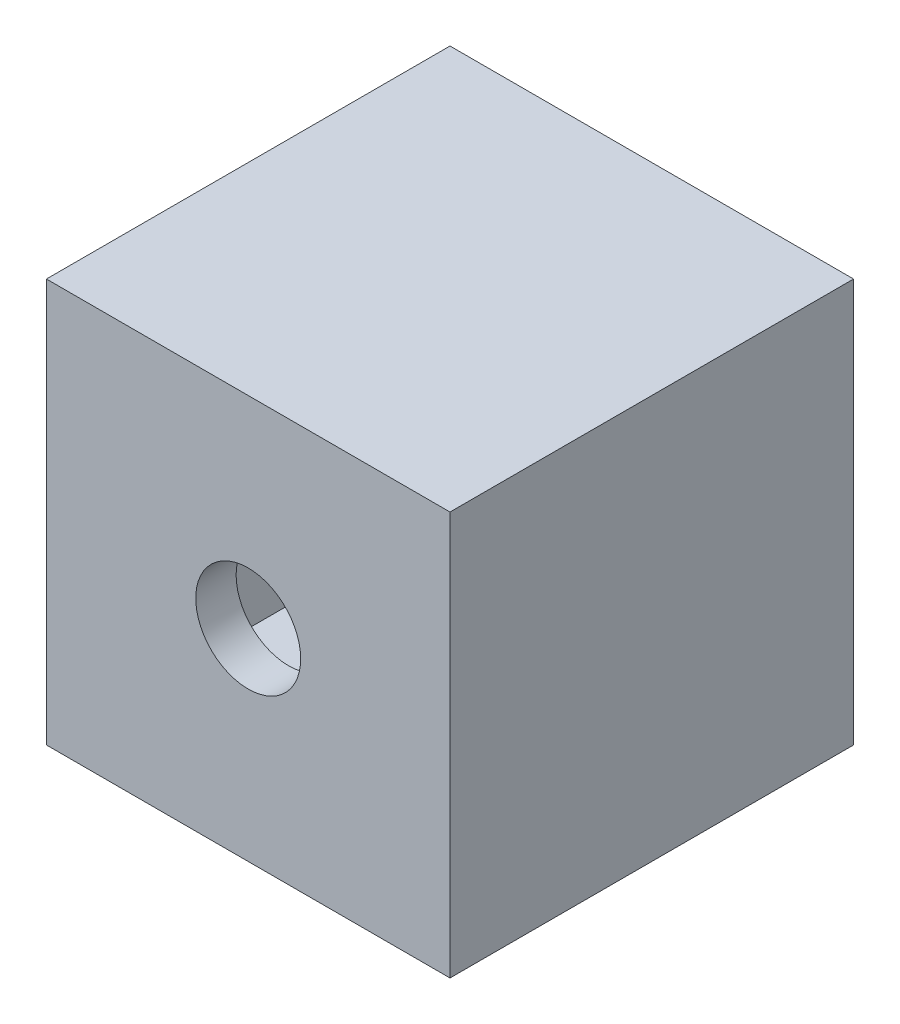
ISO-10303-21;
HEADER;
FILE_DESCRIPTION(('STEP AP214'),'2;1');
FILE_NAME('part.step','',(''),(''),'','','');
FILE_SCHEMA(('AUTOMOTIVE_DESIGN { 1 0 10303 214 1 1 1 1 }'));
ENDSEC;
DATA;
#1=APPLICATION_CONTEXT('core data for automotive mechanical design processes');
#2=APPLICATION_PROTOCOL_DEFINITION('international standard','automotive_design',2000,#1);
#3=PRODUCT_CONTEXT('',#1,'mechanical');
#4=PRODUCT('Part','Part','',(#3));
#5=PRODUCT_RELATED_PRODUCT_CATEGORY('part','',(#4));
#6=PRODUCT_DEFINITION_FORMATION('','',#4);
#7=PRODUCT_DEFINITION_CONTEXT('part definition',#1,'design');
#8=PRODUCT_DEFINITION('design','',#6,#7);
#9=PRODUCT_DEFINITION_SHAPE('','',#8);
#10=(LENGTH_UNIT() NAMED_UNIT(*) SI_UNIT(.MILLI.,.METRE.));
#11=(NAMED_UNIT(*) PLANE_ANGLE_UNIT() SI_UNIT($,.RADIAN.));
#12=(NAMED_UNIT(*) SI_UNIT($,.STERADIAN.) SOLID_ANGLE_UNIT());
#13=UNCERTAINTY_MEASURE_WITH_UNIT(LENGTH_MEASURE(1.E-05),#10,'distance_accuracy_value','');
#14=(GEOMETRIC_REPRESENTATION_CONTEXT(3) GLOBAL_UNCERTAINTY_ASSIGNED_CONTEXT((#13)) GLOBAL_UNIT_ASSIGNED_CONTEXT((#10,
#11,#12)) REPRESENTATION_CONTEXT('',''));
#15=CARTESIAN_POINT('',(0.,0.,0.));
#16=DIRECTION('',(0.,0.,1.));
#17=DIRECTION('',(1.,0.,0.));
#18=AXIS2_PLACEMENT_3D('',#15,#16,#17);
#19=CARTESIAN_POINT('',(0.,0.,0.));
#20=DIRECTION('',(0.,0.,-1.));
#21=DIRECTION('',(-1.,0.,0.));
#22=AXIS2_PLACEMENT_3D('',#19,#20,#21);
#23=PLANE('',#22);
#24=DIRECTION('',(0.,1.,0.));
#25=VECTOR('',#24,1.);
#26=CARTESIAN_POINT('',(100.,-100.,0.));
#27=LINE('',#26,#25);
#28=CARTESIAN_POINT('',(100.,-100.,0.));
#29=VERTEX_POINT('',#28);
#30=CARTESIAN_POINT('',(100.,100.,0.));
#31=VERTEX_POINT('',#30);
#32=EDGE_CURVE('E133',#29,#31,#27,.T.);
#33=ORIENTED_EDGE('',*,*,#32,.F.);
#34=DIRECTION('',(1.,0.,0.));
#35=VECTOR('',#34,1.);
#36=CARTESIAN_POINT('',(-100.,-100.,0.));
#37=LINE('',#36,#35);
#38=CARTESIAN_POINT('',(-100.,-100.,0.));
#39=VERTEX_POINT('',#38);
#40=EDGE_CURVE('E81',#39,#29,#37,.T.);
#41=ORIENTED_EDGE('',*,*,#40,.F.);
#42=DIRECTION('',(0.,-1.,0.));
#43=VECTOR('',#42,1.);
#44=CARTESIAN_POINT('',(-100.,-100.,0.));
#45=LINE('',#44,#43);
#46=CARTESIAN_POINT('',(-100.,100.,0.));
#47=VERTEX_POINT('',#46);
#48=EDGE_CURVE('E163',#47,#39,#45,.T.);
#49=ORIENTED_EDGE('',*,*,#48,.F.);
#50=DIRECTION('',(-1.,0.,0.));
#51=VECTOR('',#50,1.);
#52=CARTESIAN_POINT('',(-100.,100.,0.));
#53=LINE('',#52,#51);
#54=EDGE_CURVE('E137',#31,#47,#53,.T.);
#55=ORIENTED_EDGE('',*,*,#54,.F.);
#56=EDGE_LOOP('',(#33,#41,#49,#55));
#57=FACE_BOUND('',#56,.T.);
#58=DIRECTION('',(1.,0.,0.));
#59=VECTOR('',#58,1.);
#60=CARTESIAN_POINT('',(0.,-80.,0.));
#61=LINE('',#60,#59);
#62=CARTESIAN_POINT('',(-80.,-80.,0.));
#63=VERTEX_POINT('',#62);
#64=CARTESIAN_POINT('',(80.,-80.,0.));
#65=VERTEX_POINT('',#64);
#66=EDGE_CURVE('E128',#63,#65,#61,.T.);
#67=ORIENTED_EDGE('',*,*,#66,.T.);
#68=DIRECTION('',(0.,1.,0.));
#69=VECTOR('',#68,1.);
#70=CARTESIAN_POINT('',(80.,0.,0.));
#71=LINE('',#70,#69);
#72=CARTESIAN_POINT('',(80.,80.,0.));
#73=VERTEX_POINT('',#72);
#74=EDGE_CURVE('E149',#65,#73,#71,.T.);
#75=ORIENTED_EDGE('',*,*,#74,.T.);
#76=DIRECTION('',(-1.,0.,0.));
#77=VECTOR('',#76,1.);
#78=CARTESIAN_POINT('',(0.,80.,0.));
#79=LINE('',#78,#77);
#80=CARTESIAN_POINT('',(-80.,80.,0.));
#81=VERTEX_POINT('',#80);
#82=EDGE_CURVE('E132',#73,#81,#79,.T.);
#83=ORIENTED_EDGE('',*,*,#82,.T.);
#84=DIRECTION('',(0.,-1.,0.));
#85=VECTOR('',#84,1.);
#86=CARTESIAN_POINT('',(-80.,0.,0.));
#87=LINE('',#86,#85);
#88=EDGE_CURVE('E51',#81,#63,#87,.T.);
#89=ORIENTED_EDGE('',*,*,#88,.T.);
#90=EDGE_LOOP('',(#67,#75,#83,#89));
#91=FACE_BOUND('',#90,.T.);
#92=ADVANCED_FACE('F35',(#57,#91),#23,.T.);
#93=CARTESIAN_POINT('',(100.,-100.,200.));
#94=DIRECTION('',(-1.,0.,0.));
#95=DIRECTION('',(0.,0.,1.));
#96=AXIS2_PLACEMENT_3D('',#93,#94,#95);
#97=PLANE('',#96);
#98=ORIENTED_EDGE('',*,*,#32,.T.);
#99=DIRECTION('',(0.,0.,-1.));
#100=VECTOR('',#99,1.);
#101=CARTESIAN_POINT('',(100.,100.,200.));
#102=LINE('',#101,#100);
#103=CARTESIAN_POINT('',(100.,100.,200.));
#104=VERTEX_POINT('',#103);
#105=EDGE_CURVE('E11',#104,#31,#102,.T.);
#106=ORIENTED_EDGE('',*,*,#105,.F.);
#107=DIRECTION('',(0.,1.,0.));
#108=VECTOR('',#107,1.);
#109=CARTESIAN_POINT('',(100.,-100.,200.));
#110=LINE('',#109,#108);
#111=CARTESIAN_POINT('',(100.,-100.,200.));
#112=VERTEX_POINT('',#111);
#113=EDGE_CURVE('E155',#112,#104,#110,.T.);
#114=ORIENTED_EDGE('',*,*,#113,.F.);
#115=DIRECTION('',(0.,0.,-1.));
#116=VECTOR('',#115,1.);
#117=CARTESIAN_POINT('',(100.,-100.,200.));
#118=LINE('',#117,#116);
#119=EDGE_CURVE('E160',#112,#29,#118,.T.);
#120=ORIENTED_EDGE('',*,*,#119,.T.);
#121=EDGE_LOOP('',(#98,#106,#114,#120));
#122=FACE_BOUND('',#121,.T.);
#123=ADVANCED_FACE('F37',(#122),#97,.F.);
#124=CARTESIAN_POINT('',(-100.,100.,200.));
#125=DIRECTION('',(0.,-1.,0.));
#126=DIRECTION('',(0.,0.,-1.));
#127=AXIS2_PLACEMENT_3D('',#124,#125,#126);
#128=PLANE('',#127);
#129=ORIENTED_EDGE('',*,*,#54,.T.);
#130=DIRECTION('',(0.,0.,-1.));
#131=VECTOR('',#130,1.);
#132=CARTESIAN_POINT('',(-100.,100.,200.));
#133=LINE('',#132,#131);
#134=CARTESIAN_POINT('',(-100.,100.,200.));
#135=VERTEX_POINT('',#134);
#136=EDGE_CURVE('E44',#135,#47,#133,.T.);
#137=ORIENTED_EDGE('',*,*,#136,.F.);
#138=DIRECTION('',(-1.,0.,0.));
#139=VECTOR('',#138,1.);
#140=CARTESIAN_POINT('',(-100.,100.,200.));
#141=LINE('',#140,#139);
#142=EDGE_CURVE('E88',#104,#135,#141,.T.);
#143=ORIENTED_EDGE('',*,*,#142,.F.);
#144=ORIENTED_EDGE('',*,*,#105,.T.);
#145=EDGE_LOOP('',(#129,#137,#143,#144));
#146=FACE_BOUND('',#145,.T.);
#147=ADVANCED_FACE('F191',(#146),#128,.F.);
#148=CARTESIAN_POINT('',(-100.,-100.,200.));
#149=DIRECTION('',(1.,0.,0.));
#150=DIRECTION('',(0.,0.,-1.));
#151=AXIS2_PLACEMENT_3D('',#148,#149,#150);
#152=PLANE('',#151);
#153=ORIENTED_EDGE('',*,*,#48,.T.);
#154=DIRECTION('',(0.,0.,-1.));
#155=VECTOR('',#154,1.);
#156=CARTESIAN_POINT('',(-100.,-100.,200.));
#157=LINE('',#156,#155);
#158=CARTESIAN_POINT('',(-100.,-100.,200.));
#159=VERTEX_POINT('',#158);
#160=EDGE_CURVE('E167',#159,#39,#157,.T.);
#161=ORIENTED_EDGE('',*,*,#160,.F.);
#162=DIRECTION('',(0.,-1.,0.));
#163=VECTOR('',#162,1.);
#164=CARTESIAN_POINT('',(-100.,-100.,200.));
#165=LINE('',#164,#163);
#166=EDGE_CURVE('E158',#135,#159,#165,.T.);
#167=ORIENTED_EDGE('',*,*,#166,.F.);
#168=ORIENTED_EDGE('',*,*,#136,.T.);
#169=EDGE_LOOP('',(#153,#161,#167,#168));
#170=FACE_BOUND('',#169,.T.);
#171=ADVANCED_FACE('F173',(#170),#152,.F.);
#172=CARTESIAN_POINT('',(-100.,-100.,200.));
#173=DIRECTION('',(0.,1.,0.));
#174=DIRECTION('',(0.,0.,1.));
#175=AXIS2_PLACEMENT_3D('',#172,#173,#174);
#176=PLANE('',#175);
#177=ORIENTED_EDGE('',*,*,#40,.T.);
#178=ORIENTED_EDGE('',*,*,#119,.F.);
#179=DIRECTION('',(1.,0.,0.));
#180=VECTOR('',#179,1.);
#181=CARTESIAN_POINT('',(-100.,-100.,200.));
#182=LINE('',#181,#180);
#183=EDGE_CURVE('E60',#159,#112,#182,.T.);
#184=ORIENTED_EDGE('',*,*,#183,.F.);
#185=ORIENTED_EDGE('',*,*,#160,.T.);
#186=EDGE_LOOP('',(#177,#178,#184,#185));
#187=FACE_BOUND('',#186,.T.);
#188=ADVANCED_FACE('F181',(#187),#176,.F.);
#189=CARTESIAN_POINT('',(0.,0.,200.));
#190=DIRECTION('',(0.,0.,-1.));
#191=DIRECTION('',(-1.,0.,0.));
#192=AXIS2_PLACEMENT_3D('',#189,#190,#191);
#193=PLANE('',#192);
#194=CARTESIAN_POINT('',(0.,0.,200.));
#195=DIRECTION('',(0.,0.,1.));
#196=DIRECTION('',(1.,0.,0.));
#197=AXIS2_PLACEMENT_3D('',#194,#195,#196);
#198=CIRCLE('',#197,26.);
#199=CARTESIAN_POINT('',(26.,0.,200.));
#200=VERTEX_POINT('',#199);
#201=EDGE_CURVE('E142',#200,#200,#198,.T.);
#202=ORIENTED_EDGE('',*,*,#201,.F.);
#203=EDGE_LOOP('',(#202));
#204=FACE_BOUND('',#203,.T.);
#205=ORIENTED_EDGE('',*,*,#113,.T.);
#206=ORIENTED_EDGE('',*,*,#142,.T.);
#207=ORIENTED_EDGE('',*,*,#166,.T.);
#208=ORIENTED_EDGE('',*,*,#183,.T.);
#209=EDGE_LOOP('',(#205,#206,#207,#208));
#210=FACE_BOUND('',#209,.T.);
#211=ADVANCED_FACE('F183',(#204,#210),#193,.F.);
#212=CARTESIAN_POINT('',(80.,-100.,200.));
#213=DIRECTION('',(-1.,0.,0.));
#214=DIRECTION('',(0.,0.,1.));
#215=AXIS2_PLACEMENT_3D('',#212,#213,#214);
#216=PLANE('',#215);
#217=ORIENTED_EDGE('',*,*,#74,.F.);
#218=DIRECTION('',(0.,0.,-1.));
#219=VECTOR('',#218,1.);
#220=CARTESIAN_POINT('',(80.,-80.,200.));
#221=LINE('',#220,#219);
#222=CARTESIAN_POINT('',(80.,-80.,180.));
#223=VERTEX_POINT('',#222);
#224=EDGE_CURVE('E127',#223,#65,#221,.T.);
#225=ORIENTED_EDGE('',*,*,#224,.F.);
#226=DIRECTION('',(0.,1.,0.));
#227=VECTOR('',#226,1.);
#228=CARTESIAN_POINT('',(80.,0.,180.));
#229=LINE('',#228,#227);
#230=CARTESIAN_POINT('',(80.,80.,180.));
#231=VERTEX_POINT('',#230);
#232=EDGE_CURVE('E115',#223,#231,#229,.T.);
#233=ORIENTED_EDGE('',*,*,#232,.T.);
#234=DIRECTION('',(0.,0.,-1.));
#235=VECTOR('',#234,1.);
#236=CARTESIAN_POINT('',(80.,80.,200.));
#237=LINE('',#236,#235);
#238=EDGE_CURVE('E125',#231,#73,#237,.T.);
#239=ORIENTED_EDGE('',*,*,#238,.T.);
#240=EDGE_LOOP('',(#217,#225,#233,#239));
#241=FACE_BOUND('',#240,.T.);
#242=ADVANCED_FACE('F124',(#241),#216,.T.);
#243=CARTESIAN_POINT('',(-100.,80.,200.));
#244=DIRECTION('',(0.,-1.,0.));
#245=DIRECTION('',(0.,0.,-1.));
#246=AXIS2_PLACEMENT_3D('',#243,#244,#245);
#247=PLANE('',#246);
#248=ORIENTED_EDGE('',*,*,#82,.F.);
#249=ORIENTED_EDGE('',*,*,#238,.F.);
#250=DIRECTION('',(-1.,0.,0.));
#251=VECTOR('',#250,1.);
#252=CARTESIAN_POINT('',(0.,80.,180.));
#253=LINE('',#252,#251);
#254=CARTESIAN_POINT('',(-80.,80.,180.));
#255=VERTEX_POINT('',#254);
#256=EDGE_CURVE('E111',#231,#255,#253,.T.);
#257=ORIENTED_EDGE('',*,*,#256,.T.);
#258=DIRECTION('',(0.,0.,-1.));
#259=VECTOR('',#258,1.);
#260=CARTESIAN_POINT('',(-80.,80.,200.));
#261=LINE('',#260,#259);
#262=EDGE_CURVE('E134',#255,#81,#261,.T.);
#263=ORIENTED_EDGE('',*,*,#262,.T.);
#264=EDGE_LOOP('',(#248,#249,#257,#263));
#265=FACE_BOUND('',#264,.T.);
#266=ADVANCED_FACE('F130',(#265),#247,.T.);
#267=CARTESIAN_POINT('',(-80.,-100.,200.));
#268=DIRECTION('',(1.,0.,0.));
#269=DIRECTION('',(0.,0.,-1.));
#270=AXIS2_PLACEMENT_3D('',#267,#268,#269);
#271=PLANE('',#270);
#272=ORIENTED_EDGE('',*,*,#88,.F.);
#273=ORIENTED_EDGE('',*,*,#262,.F.);
#274=DIRECTION('',(0.,-1.,0.));
#275=VECTOR('',#274,1.);
#276=CARTESIAN_POINT('',(-80.,0.,180.));
#277=LINE('',#276,#275);
#278=CARTESIAN_POINT('',(-80.,-80.,180.));
#279=VERTEX_POINT('',#278);
#280=EDGE_CURVE('E116',#255,#279,#277,.T.);
#281=ORIENTED_EDGE('',*,*,#280,.T.);
#282=DIRECTION('',(0.,0.,-1.));
#283=VECTOR('',#282,1.);
#284=CARTESIAN_POINT('',(-80.,-80.,200.));
#285=LINE('',#284,#283);
#286=EDGE_CURVE('E139',#279,#63,#285,.T.);
#287=ORIENTED_EDGE('',*,*,#286,.T.);
#288=EDGE_LOOP('',(#272,#273,#281,#287));
#289=FACE_BOUND('',#288,.T.);
#290=ADVANCED_FACE('F206',(#289),#271,.T.);
#291=CARTESIAN_POINT('',(-100.,-80.,200.));
#292=DIRECTION('',(0.,1.,0.));
#293=DIRECTION('',(0.,0.,1.));
#294=AXIS2_PLACEMENT_3D('',#291,#292,#293);
#295=PLANE('',#294);
#296=ORIENTED_EDGE('',*,*,#66,.F.);
#297=ORIENTED_EDGE('',*,*,#286,.F.);
#298=DIRECTION('',(1.,0.,0.));
#299=VECTOR('',#298,1.);
#300=CARTESIAN_POINT('',(0.,-80.,180.));
#301=LINE('',#300,#299);
#302=EDGE_CURVE('E144',#279,#223,#301,.T.);
#303=ORIENTED_EDGE('',*,*,#302,.T.);
#304=ORIENTED_EDGE('',*,*,#224,.T.);
#305=EDGE_LOOP('',(#296,#297,#303,#304));
#306=FACE_BOUND('',#305,.T.);
#307=ADVANCED_FACE('F202',(#306),#295,.T.);
#308=CARTESIAN_POINT('',(0.,0.,180.));
#309=DIRECTION('',(0.,0.,-1.));
#310=DIRECTION('',(-1.,0.,0.));
#311=AXIS2_PLACEMENT_3D('',#308,#309,#310);
#312=PLANE('',#311);
#313=CARTESIAN_POINT('',(0.,0.,180.));
#314=DIRECTION('',(0.,0.,-1.));
#315=DIRECTION('',(-1.,0.,0.));
#316=AXIS2_PLACEMENT_3D('',#313,#314,#315);
#317=CIRCLE('',#316,26.);
#318=CARTESIAN_POINT('',(-26.,0.,180.));
#319=VERTEX_POINT('',#318);
#320=EDGE_CURVE('E39',#319,#319,#317,.T.);
#321=ORIENTED_EDGE('',*,*,#320,.F.);
#322=EDGE_LOOP('',(#321));
#323=FACE_BOUND('',#322,.T.);
#324=ORIENTED_EDGE('',*,*,#232,.F.);
#325=ORIENTED_EDGE('',*,*,#302,.F.);
#326=ORIENTED_EDGE('',*,*,#280,.F.);
#327=ORIENTED_EDGE('',*,*,#256,.F.);
#328=EDGE_LOOP('',(#324,#325,#326,#327));
#329=FACE_BOUND('',#328,.T.);
#330=ADVANCED_FACE('F113',(#323,#329),#312,.T.);
#331=CARTESIAN_POINT('',(0.,0.,148.4));
#332=DIRECTION('',(0.,0.,1.));
#333=DIRECTION('',(1.,0.,0.));
#334=AXIS2_PLACEMENT_3D('',#331,#332,#333);
#335=CYLINDRICAL_SURFACE('',#334,26.);
#336=ORIENTED_EDGE('',*,*,#320,.T.);
#337=EDGE_LOOP('',(#336));
#338=FACE_BOUND('',#337,.T.);
#339=ORIENTED_EDGE('',*,*,#201,.T.);
#340=EDGE_LOOP('',(#339));
#341=FACE_BOUND('',#340,.T.);
#342=ADVANCED_FACE('F201',(#338,#341),#335,.F.);
#343=CLOSED_SHELL('',(#92,#123,#147,#171,#188,#211,#242,#266,#290,#307,#330,#342));
#344=MANIFOLD_SOLID_BREP('B2',#343);
#345=ADVANCED_BREP_SHAPE_REPRESENTATION('',(#18,#344),#14);
#346=SHAPE_DEFINITION_REPRESENTATION(#9,#345);
ENDSEC;
END-ISO-10303-21;
